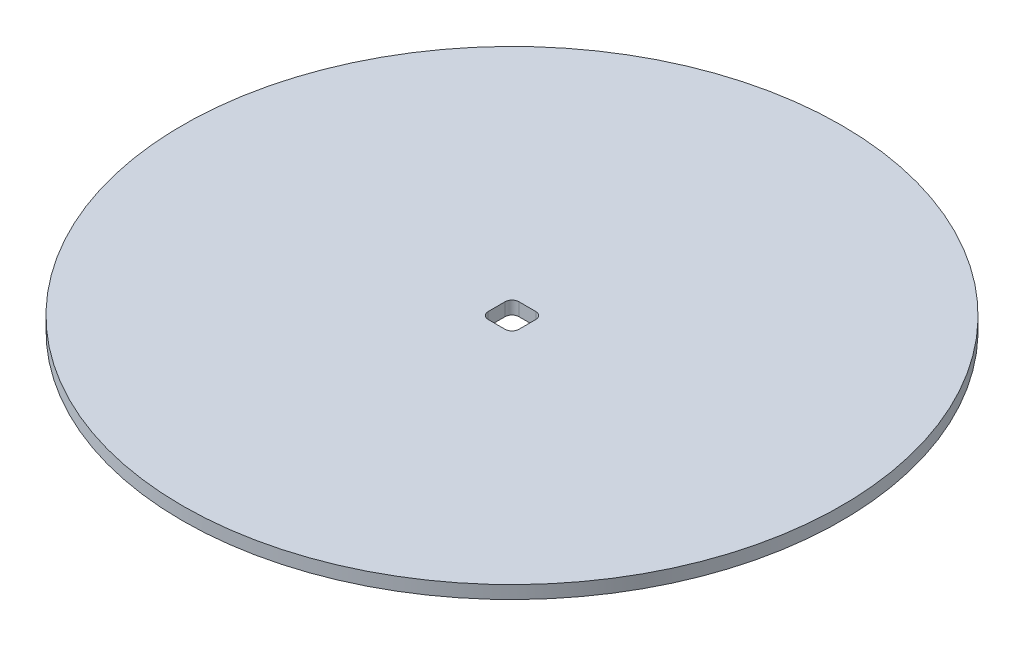
ISO-10303-21;
HEADER;
FILE_DESCRIPTION(('STEP AP214'),'2;1');
FILE_NAME('part.step','',(''),(''),'','','');
FILE_SCHEMA(('AUTOMOTIVE_DESIGN { 1 0 10303 214 1 1 1 1 }'));
ENDSEC;
DATA;
#1=APPLICATION_CONTEXT('core data for automotive mechanical design processes');
#2=APPLICATION_PROTOCOL_DEFINITION('international standard','automotive_design',2000,#1);
#3=PRODUCT_CONTEXT('',#1,'mechanical');
#4=PRODUCT('Part','Part','',(#3));
#5=PRODUCT_RELATED_PRODUCT_CATEGORY('part','',(#4));
#6=PRODUCT_DEFINITION_FORMATION('','',#4);
#7=PRODUCT_DEFINITION_CONTEXT('part definition',#1,'design');
#8=PRODUCT_DEFINITION('design','',#6,#7);
#9=PRODUCT_DEFINITION_SHAPE('','',#8);
#10=(LENGTH_UNIT() NAMED_UNIT(*) SI_UNIT(.MILLI.,.METRE.));
#11=(NAMED_UNIT(*) PLANE_ANGLE_UNIT() SI_UNIT($,.RADIAN.));
#12=(NAMED_UNIT(*) SI_UNIT($,.STERADIAN.) SOLID_ANGLE_UNIT());
#13=UNCERTAINTY_MEASURE_WITH_UNIT(LENGTH_MEASURE(1.E-05),#10,'distance_accuracy_value','');
#14=(GEOMETRIC_REPRESENTATION_CONTEXT(3) GLOBAL_UNCERTAINTY_ASSIGNED_CONTEXT((#13)) GLOBAL_UNIT_ASSIGNED_CONTEXT((#10,
#11,#12)) REPRESENTATION_CONTEXT('',''));
#15=CARTESIAN_POINT('',(0.,0.,0.));
#16=DIRECTION('',(0.,0.,1.));
#17=DIRECTION('',(1.,0.,0.));
#18=AXIS2_PLACEMENT_3D('',#15,#16,#17);
#19=CARTESIAN_POINT('',(0.,0.,0.));
#20=DIRECTION('',(0.,1.,0.));
#21=DIRECTION('',(0.,0.,1.));
#22=AXIS2_PLACEMENT_3D('',#19,#20,#21);
#23=PLANE('',#22);
#24=DIRECTION('',(-1.,0.,0.));
#25=VECTOR('',#24,1.);
#26=CARTESIAN_POINT('',(1.96849999999999,0.,3.556));
#27=LINE('',#26,#25);
#28=CARTESIAN_POINT('',(1.96849999999999,0.,3.556));
#29=VERTEX_POINT('',#28);
#30=CARTESIAN_POINT('',(-1.96849999999999,0.,3.556));
#31=VERTEX_POINT('',#30);
#32=EDGE_CURVE('E83',#29,#31,#27,.T.);
#33=ORIENTED_EDGE('',*,*,#32,.F.);
#34=CARTESIAN_POINT('',(1.9685,0.,1.9685));
#35=DIRECTION('',(0.,-1.,0.));
#36=DIRECTION('',(0.,0.,-1.));
#37=AXIS2_PLACEMENT_3D('',#34,#35,#36);
#38=CIRCLE('',#37,1.5875);
#39=CARTESIAN_POINT('',(3.556,0.,1.9685));
#40=VERTEX_POINT('',#39);
#41=EDGE_CURVE('E128',#29,#40,#38,.F.);
#42=ORIENTED_EDGE('',*,*,#41,.T.);
#43=DIRECTION('',(0.,0.,1.));
#44=VECTOR('',#43,1.);
#45=CARTESIAN_POINT('',(3.556,0.,-1.96849999999999));
#46=LINE('',#45,#44);
#47=CARTESIAN_POINT('',(3.556,0.,-1.96849999999999));
#48=VERTEX_POINT('',#47);
#49=EDGE_CURVE('E106',#48,#40,#46,.T.);
#50=ORIENTED_EDGE('',*,*,#49,.F.);
#51=CARTESIAN_POINT('',(1.9685,0.,-1.9685));
#52=DIRECTION('',(0.,-1.,0.));
#53=DIRECTION('',(0.,0.,-1.));
#54=AXIS2_PLACEMENT_3D('',#51,#52,#53);
#55=CIRCLE('',#54,1.5875);
#56=CARTESIAN_POINT('',(1.9685,0.,-3.556));
#57=VERTEX_POINT('',#56);
#58=EDGE_CURVE('E109',#48,#57,#55,.F.);
#59=ORIENTED_EDGE('',*,*,#58,.T.);
#60=DIRECTION('',(1.,0.,0.));
#61=VECTOR('',#60,1.);
#62=CARTESIAN_POINT('',(1.96849999999999,0.,-3.556));
#63=LINE('',#62,#61);
#64=CARTESIAN_POINT('',(-1.96849999999999,0.,-3.556));
#65=VERTEX_POINT('',#64);
#66=EDGE_CURVE('E110',#65,#57,#63,.T.);
#67=ORIENTED_EDGE('',*,*,#66,.F.);
#68=CARTESIAN_POINT('',(-1.9685,0.,-1.9685));
#69=DIRECTION('',(0.,-1.,0.));
#70=DIRECTION('',(0.,0.,-1.));
#71=AXIS2_PLACEMENT_3D('',#68,#69,#70);
#72=CIRCLE('',#71,1.5875);
#73=CARTESIAN_POINT('',(-3.556,0.,-1.96849999999999));
#74=VERTEX_POINT('',#73);
#75=EDGE_CURVE('E113',#65,#74,#72,.F.);
#76=ORIENTED_EDGE('',*,*,#75,.T.);
#77=DIRECTION('',(0.,0.,-1.));
#78=VECTOR('',#77,1.);
#79=CARTESIAN_POINT('',(-3.556,0.,-1.96849999999999));
#80=LINE('',#79,#78);
#81=CARTESIAN_POINT('',(-3.556,0.,1.9685));
#82=VERTEX_POINT('',#81);
#83=EDGE_CURVE('E78',#82,#74,#80,.T.);
#84=ORIENTED_EDGE('',*,*,#83,.F.);
#85=CARTESIAN_POINT('',(-1.9685,0.,1.9685));
#86=DIRECTION('',(0.,-1.,0.));
#87=DIRECTION('',(0.,0.,-1.));
#88=AXIS2_PLACEMENT_3D('',#85,#86,#87);
#89=CIRCLE('',#88,1.5875);
#90=EDGE_CURVE('E93',#82,#31,#89,.F.);
#91=ORIENTED_EDGE('',*,*,#90,.T.);
#92=EDGE_LOOP('',(#33,#42,#50,#59,#67,#76,#84,#91));
#93=FACE_BOUND('',#92,.T.);
#94=CARTESIAN_POINT('',(0.,0.,0.));
#95=DIRECTION('',(0.,-1.,0.));
#96=DIRECTION('',(0.,0.,-1.));
#97=AXIS2_PLACEMENT_3D('',#94,#95,#96);
#98=CIRCLE('',#97,76.2);
#99=CARTESIAN_POINT('',(0.,0.,-76.2));
#100=VERTEX_POINT('',#99);
#101=EDGE_CURVE('E19',#100,#100,#98,.F.);
#102=ORIENTED_EDGE('',*,*,#101,.F.);
#103=EDGE_LOOP('',(#102));
#104=FACE_BOUND('',#103,.T.);
#105=ADVANCED_FACE('F16',(#93,#104),#23,.F.);
#106=CARTESIAN_POINT('',(0.,3.,0.));
#107=DIRECTION('',(0.,-1.,0.));
#108=DIRECTION('',(0.,0.,-1.));
#109=AXIS2_PLACEMENT_3D('',#106,#107,#108);
#110=CYLINDRICAL_SURFACE('',#109,76.2);
#111=ORIENTED_EDGE('',*,*,#101,.T.);
#112=EDGE_LOOP('',(#111));
#113=FACE_BOUND('',#112,.T.);
#114=CARTESIAN_POINT('',(0.,3.,0.));
#115=DIRECTION('',(0.,-1.,0.));
#116=DIRECTION('',(0.,0.,-1.));
#117=AXIS2_PLACEMENT_3D('',#114,#115,#116);
#118=CIRCLE('',#117,76.2);
#119=CARTESIAN_POINT('',(0.,3.,-76.2));
#120=VERTEX_POINT('',#119);
#121=EDGE_CURVE('E125',#120,#120,#118,.F.);
#122=ORIENTED_EDGE('',*,*,#121,.F.);
#123=EDGE_LOOP('',(#122));
#124=FACE_BOUND('',#123,.T.);
#125=ADVANCED_FACE('F190',(#113,#124),#110,.T.);
#126=CARTESIAN_POINT('',(1.96849999999999,3.,3.556));
#127=DIRECTION('',(0.,0.,-1.));
#128=DIRECTION('',(-1.,0.,0.));
#129=AXIS2_PLACEMENT_3D('',#126,#127,#128);
#130=PLANE('',#129);
#131=DIRECTION('',(1.,0.,0.));
#132=VECTOR('',#131,1.);
#133=CARTESIAN_POINT('',(0.,3.,3.556));
#134=LINE('',#133,#132);
#135=CARTESIAN_POINT('',(1.96849999999999,3.,3.556));
#136=VERTEX_POINT('',#135);
#137=CARTESIAN_POINT('',(-1.96849999999999,3.,3.556));
#138=VERTEX_POINT('',#137);
#139=EDGE_CURVE('E124',#136,#138,#134,.F.);
#140=ORIENTED_EDGE('',*,*,#139,.F.);
#141=DIRECTION('',(0.,-1.,0.));
#142=VECTOR('',#141,1.);
#143=CARTESIAN_POINT('',(1.96849999999999,3.,3.556));
#144=LINE('',#143,#142);
#145=EDGE_CURVE('E89',#136,#29,#144,.T.);
#146=ORIENTED_EDGE('',*,*,#145,.T.);
#147=ORIENTED_EDGE('',*,*,#32,.T.);
#148=DIRECTION('',(0.,-1.,0.));
#149=VECTOR('',#148,1.);
#150=CARTESIAN_POINT('',(-1.96849999999999,3.,3.556));
#151=LINE('',#150,#149);
#152=EDGE_CURVE('E86',#31,#138,#151,.F.);
#153=ORIENTED_EDGE('',*,*,#152,.T.);
#154=EDGE_LOOP('',(#140,#146,#147,#153));
#155=FACE_BOUND('',#154,.T.);
#156=ADVANCED_FACE('F84',(#155),#130,.T.);
#157=CARTESIAN_POINT('',(-1.9685,3.,1.9685));
#158=DIRECTION('',(0.,-1.,0.));
#159=DIRECTION('',(0.,0.,-1.));
#160=AXIS2_PLACEMENT_3D('',#157,#158,#159);
#161=CYLINDRICAL_SURFACE('',#160,1.5875);
#162=DIRECTION('',(0.,1.,0.));
#163=VECTOR('',#162,1.);
#164=CARTESIAN_POINT('',(-3.556,3.,1.96849999999999));
#165=LINE('',#164,#163);
#166=CARTESIAN_POINT('',(-3.556,3.,1.9685));
#167=VERTEX_POINT('',#166);
#168=EDGE_CURVE('E103',#167,#82,#165,.F.);
#169=ORIENTED_EDGE('',*,*,#168,.F.);
#170=CARTESIAN_POINT('',(-1.9685,3.,1.9685));
#171=DIRECTION('',(0.,-1.,0.));
#172=DIRECTION('',(0.,0.,-1.));
#173=AXIS2_PLACEMENT_3D('',#170,#171,#172);
#174=CIRCLE('',#173,1.5875);
#175=EDGE_CURVE('E99',#138,#167,#174,.T.);
#176=ORIENTED_EDGE('',*,*,#175,.F.);
#177=ORIENTED_EDGE('',*,*,#152,.F.);
#178=ORIENTED_EDGE('',*,*,#90,.F.);
#179=EDGE_LOOP('',(#169,#176,#177,#178));
#180=FACE_BOUND('',#179,.T.);
#181=ADVANCED_FACE('F97',(#180),#161,.F.);
#182=CARTESIAN_POINT('',(-3.556,3.,-1.96849999999999));
#183=DIRECTION('',(1.,0.,0.));
#184=DIRECTION('',(0.,0.,-1.));
#185=AXIS2_PLACEMENT_3D('',#182,#183,#184);
#186=PLANE('',#185);
#187=DIRECTION('',(0.,0.,1.));
#188=VECTOR('',#187,1.);
#189=CARTESIAN_POINT('',(-3.556,3.,0.));
#190=LINE('',#189,#188);
#191=CARTESIAN_POINT('',(-3.556,3.,-1.96849999999999));
#192=VERTEX_POINT('',#191);
#193=EDGE_CURVE('E122',#167,#192,#190,.F.);
#194=ORIENTED_EDGE('',*,*,#193,.F.);
#195=ORIENTED_EDGE('',*,*,#168,.T.);
#196=ORIENTED_EDGE('',*,*,#83,.T.);
#197=DIRECTION('',(0.,-1.,0.));
#198=VECTOR('',#197,1.);
#199=CARTESIAN_POINT('',(-3.556,3.,-1.96849999999999));
#200=LINE('',#199,#198);
#201=EDGE_CURVE('E133',#74,#192,#200,.F.);
#202=ORIENTED_EDGE('',*,*,#201,.T.);
#203=EDGE_LOOP('',(#194,#195,#196,#202));
#204=FACE_BOUND('',#203,.T.);
#205=ADVANCED_FACE('F183',(#204),#186,.T.);
#206=CARTESIAN_POINT('',(-1.9685,3.,-1.9685));
#207=DIRECTION('',(0.,-1.,0.));
#208=DIRECTION('',(0.,0.,-1.));
#209=AXIS2_PLACEMENT_3D('',#206,#207,#208);
#210=CYLINDRICAL_SURFACE('',#209,1.5875);
#211=DIRECTION('',(0.,1.,0.));
#212=VECTOR('',#211,1.);
#213=CARTESIAN_POINT('',(-1.96849999999999,3.,-3.556));
#214=LINE('',#213,#212);
#215=CARTESIAN_POINT('',(-1.96849999999999,3.,-3.556));
#216=VERTEX_POINT('',#215);
#217=EDGE_CURVE('E112',#216,#65,#214,.F.);
#218=ORIENTED_EDGE('',*,*,#217,.F.);
#219=CARTESIAN_POINT('',(-1.9685,3.,-1.9685));
#220=DIRECTION('',(0.,-1.,0.));
#221=DIRECTION('',(0.,0.,-1.));
#222=AXIS2_PLACEMENT_3D('',#219,#220,#221);
#223=CIRCLE('',#222,1.5875);
#224=EDGE_CURVE('E119',#192,#216,#223,.T.);
#225=ORIENTED_EDGE('',*,*,#224,.F.);
#226=ORIENTED_EDGE('',*,*,#201,.F.);
#227=ORIENTED_EDGE('',*,*,#75,.F.);
#228=EDGE_LOOP('',(#218,#225,#226,#227));
#229=FACE_BOUND('',#228,.T.);
#230=ADVANCED_FACE('F179',(#229),#210,.F.);
#231=CARTESIAN_POINT('',(1.96849999999999,3.,-3.556));
#232=DIRECTION('',(0.,0.,1.));
#233=DIRECTION('',(1.,0.,0.));
#234=AXIS2_PLACEMENT_3D('',#231,#232,#233);
#235=PLANE('',#234);
#236=DIRECTION('',(1.,0.,0.));
#237=VECTOR('',#236,1.);
#238=CARTESIAN_POINT('',(0.,3.,-3.556));
#239=LINE('',#238,#237);
#240=CARTESIAN_POINT('',(1.9685,3.,-3.556));
#241=VERTEX_POINT('',#240);
#242=EDGE_CURVE('E118',#216,#241,#239,.T.);
#243=ORIENTED_EDGE('',*,*,#242,.F.);
#244=ORIENTED_EDGE('',*,*,#217,.T.);
#245=ORIENTED_EDGE('',*,*,#66,.T.);
#246=DIRECTION('',(0.,-1.,0.));
#247=VECTOR('',#246,1.);
#248=CARTESIAN_POINT('',(1.9685,3.,-3.556));
#249=LINE('',#248,#247);
#250=EDGE_CURVE('E132',#57,#241,#249,.F.);
#251=ORIENTED_EDGE('',*,*,#250,.T.);
#252=EDGE_LOOP('',(#243,#244,#245,#251));
#253=FACE_BOUND('',#252,.T.);
#254=ADVANCED_FACE('F176',(#253),#235,.T.);
#255=CARTESIAN_POINT('',(1.9685,3.,-1.9685));
#256=DIRECTION('',(0.,-1.,0.));
#257=DIRECTION('',(0.,0.,-1.));
#258=AXIS2_PLACEMENT_3D('',#255,#256,#257);
#259=CYLINDRICAL_SURFACE('',#258,1.5875);
#260=DIRECTION('',(0.,1.,0.));
#261=VECTOR('',#260,1.);
#262=CARTESIAN_POINT('',(3.556,3.,-1.96849999999999));
#263=LINE('',#262,#261);
#264=CARTESIAN_POINT('',(3.556,3.,-1.96849999999999));
#265=VERTEX_POINT('',#264);
#266=EDGE_CURVE('E108',#265,#48,#263,.F.);
#267=ORIENTED_EDGE('',*,*,#266,.F.);
#268=CARTESIAN_POINT('',(1.9685,3.,-1.9685));
#269=DIRECTION('',(0.,-1.,0.));
#270=DIRECTION('',(0.,0.,-1.));
#271=AXIS2_PLACEMENT_3D('',#268,#269,#270);
#272=CIRCLE('',#271,1.5875);
#273=EDGE_CURVE('E115',#241,#265,#272,.T.);
#274=ORIENTED_EDGE('',*,*,#273,.F.);
#275=ORIENTED_EDGE('',*,*,#250,.F.);
#276=ORIENTED_EDGE('',*,*,#58,.F.);
#277=EDGE_LOOP('',(#267,#274,#275,#276));
#278=FACE_BOUND('',#277,.T.);
#279=ADVANCED_FACE('F160',(#278),#259,.F.);
#280=CARTESIAN_POINT('',(3.556,3.,-1.96849999999999));
#281=DIRECTION('',(-1.,0.,0.));
#282=DIRECTION('',(0.,0.,1.));
#283=AXIS2_PLACEMENT_3D('',#280,#281,#282);
#284=PLANE('',#283);
#285=DIRECTION('',(0.,0.,1.));
#286=VECTOR('',#285,1.);
#287=CARTESIAN_POINT('',(3.556,3.,0.));
#288=LINE('',#287,#286);
#289=CARTESIAN_POINT('',(3.556,3.,1.9685));
#290=VERTEX_POINT('',#289);
#291=EDGE_CURVE('E25',#265,#290,#288,.T.);
#292=ORIENTED_EDGE('',*,*,#291,.F.);
#293=ORIENTED_EDGE('',*,*,#266,.T.);
#294=ORIENTED_EDGE('',*,*,#49,.T.);
#295=DIRECTION('',(0.,-1.,0.));
#296=VECTOR('',#295,1.);
#297=CARTESIAN_POINT('',(3.556,3.,1.96849999999999));
#298=LINE('',#297,#296);
#299=EDGE_CURVE('E34',#40,#290,#298,.F.);
#300=ORIENTED_EDGE('',*,*,#299,.T.);
#301=EDGE_LOOP('',(#292,#293,#294,#300));
#302=FACE_BOUND('',#301,.T.);
#303=ADVANCED_FACE('F157',(#302),#284,.T.);
#304=CARTESIAN_POINT('',(1.9685,3.,1.9685));
#305=DIRECTION('',(0.,-1.,0.));
#306=DIRECTION('',(0.,0.,-1.));
#307=AXIS2_PLACEMENT_3D('',#304,#305,#306);
#308=CYLINDRICAL_SURFACE('',#307,1.5875);
#309=ORIENTED_EDGE('',*,*,#145,.F.);
#310=CARTESIAN_POINT('',(1.9685,3.,1.9685));
#311=DIRECTION('',(0.,-1.,0.));
#312=DIRECTION('',(0.,0.,-1.));
#313=AXIS2_PLACEMENT_3D('',#310,#311,#312);
#314=CIRCLE('',#313,1.5875);
#315=EDGE_CURVE('E11',#290,#136,#314,.T.);
#316=ORIENTED_EDGE('',*,*,#315,.F.);
#317=ORIENTED_EDGE('',*,*,#299,.F.);
#318=ORIENTED_EDGE('',*,*,#41,.F.);
#319=EDGE_LOOP('',(#309,#316,#317,#318));
#320=FACE_BOUND('',#319,.T.);
#321=ADVANCED_FACE('F163',(#320),#308,.F.);
#322=CARTESIAN_POINT('',(0.,3.,0.));
#323=DIRECTION('',(0.,1.,0.));
#324=DIRECTION('',(0.,0.,1.));
#325=AXIS2_PLACEMENT_3D('',#322,#323,#324);
#326=PLANE('',#325);
#327=ORIENTED_EDGE('',*,*,#291,.T.);
#328=ORIENTED_EDGE('',*,*,#315,.T.);
#329=ORIENTED_EDGE('',*,*,#139,.T.);
#330=ORIENTED_EDGE('',*,*,#175,.T.);
#331=ORIENTED_EDGE('',*,*,#193,.T.);
#332=ORIENTED_EDGE('',*,*,#224,.T.);
#333=ORIENTED_EDGE('',*,*,#242,.T.);
#334=ORIENTED_EDGE('',*,*,#273,.T.);
#335=EDGE_LOOP('',(#327,#328,#329,#330,#331,#332,#333,#334));
#336=FACE_BOUND('',#335,.T.);
#337=ORIENTED_EDGE('',*,*,#121,.T.);
#338=EDGE_LOOP('',(#337));
#339=FACE_BOUND('',#338,.T.);
#340=ADVANCED_FACE('F154',(#336,#339),#326,.T.);
#341=CLOSED_SHELL('',(#105,#125,#156,#181,#205,#230,#254,#279,#303,#321,#340));
#342=MANIFOLD_SOLID_BREP('B1',#341);
#343=ADVANCED_BREP_SHAPE_REPRESENTATION('',(#18,#342),#14);
#344=SHAPE_DEFINITION_REPRESENTATION(#9,#343);
ENDSEC;
END-ISO-10303-21;
